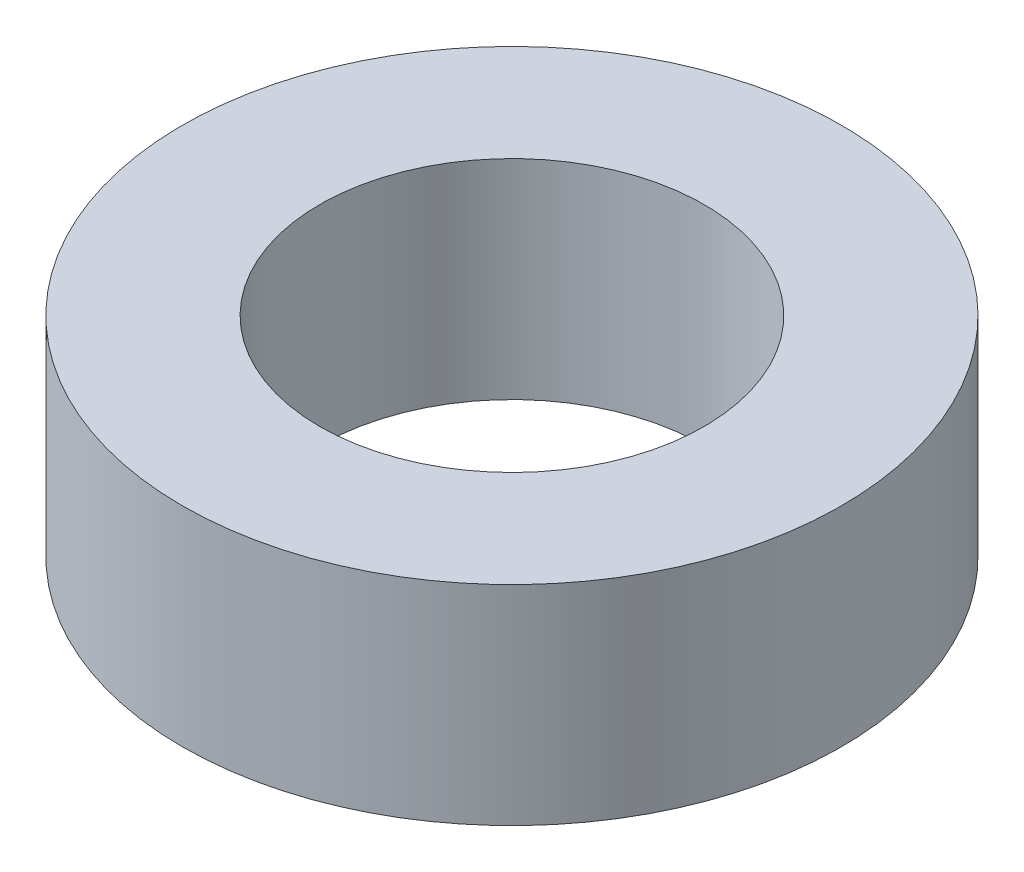
ISO-10303-21;
HEADER;
FILE_DESCRIPTION(('STEP AP214'),'2;1');
FILE_NAME('part.step','',(''),(''),'','','');
FILE_SCHEMA(('AUTOMOTIVE_DESIGN { 1 0 10303 214 1 1 1 1 }'));
ENDSEC;
DATA;
#1=APPLICATION_CONTEXT('core data for automotive mechanical design processes');
#2=APPLICATION_PROTOCOL_DEFINITION('international standard','automotive_design',2000,#1);
#3=PRODUCT_CONTEXT('',#1,'mechanical');
#4=PRODUCT('Part','Part','',(#3));
#5=PRODUCT_RELATED_PRODUCT_CATEGORY('part','',(#4));
#6=PRODUCT_DEFINITION_FORMATION('','',#4);
#7=PRODUCT_DEFINITION_CONTEXT('part definition',#1,'design');
#8=PRODUCT_DEFINITION('design','',#6,#7);
#9=PRODUCT_DEFINITION_SHAPE('','',#8);
#10=(LENGTH_UNIT() NAMED_UNIT(*) SI_UNIT(.MILLI.,.METRE.));
#11=(NAMED_UNIT(*) PLANE_ANGLE_UNIT() SI_UNIT($,.RADIAN.));
#12=(NAMED_UNIT(*) SI_UNIT($,.STERADIAN.) SOLID_ANGLE_UNIT());
#13=UNCERTAINTY_MEASURE_WITH_UNIT(LENGTH_MEASURE(1.E-05),#10,'distance_accuracy_value','');
#14=(GEOMETRIC_REPRESENTATION_CONTEXT(3) GLOBAL_UNCERTAINTY_ASSIGNED_CONTEXT((#13)) GLOBAL_UNIT_ASSIGNED_CONTEXT((#10,
#11,#12)) REPRESENTATION_CONTEXT('',''));
#15=CARTESIAN_POINT('',(0.,0.,0.));
#16=DIRECTION('',(0.,0.,1.));
#17=DIRECTION('',(1.,0.,0.));
#18=AXIS2_PLACEMENT_3D('',#15,#16,#17);
#19=CARTESIAN_POINT('',(0.,19.,0.));
#20=DIRECTION('',(0.,-1.,0.));
#21=DIRECTION('',(0.,0.,-1.));
#22=AXIS2_PLACEMENT_3D('',#19,#20,#21);
#23=CYLINDRICAL_SURFACE('',#22,30.);
#24=CARTESIAN_POINT('',(0.,19.,0.));
#25=DIRECTION('',(0.,1.,0.));
#26=DIRECTION('',(0.,0.,1.));
#27=AXIS2_PLACEMENT_3D('',#24,#25,#26);
#28=CIRCLE('',#27,30.);
#29=CARTESIAN_POINT('',(0.,19.,30.));
#30=VERTEX_POINT('',#29);
#31=EDGE_CURVE('E10',#30,#30,#28,.T.);
#32=ORIENTED_EDGE('',*,*,#31,.F.);
#33=EDGE_LOOP('',(#32));
#34=FACE_BOUND('',#33,.T.);
#35=CARTESIAN_POINT('',(0.,0.,0.));
#36=DIRECTION('',(0.,1.,0.));
#37=DIRECTION('',(0.,0.,1.));
#38=AXIS2_PLACEMENT_3D('',#35,#36,#37);
#39=CIRCLE('',#38,30.);
#40=CARTESIAN_POINT('',(0.,0.,30.));
#41=VERTEX_POINT('',#40);
#42=EDGE_CURVE('E37',#41,#41,#39,.T.);
#43=ORIENTED_EDGE('',*,*,#42,.T.);
#44=EDGE_LOOP('',(#43));
#45=FACE_BOUND('',#44,.T.);
#46=ADVANCED_FACE('F40',(#34,#45),#23,.T.);
#47=CARTESIAN_POINT('',(0.,19.,0.));
#48=DIRECTION('',(0.,1.,0.));
#49=DIRECTION('',(0.,0.,1.));
#50=AXIS2_PLACEMENT_3D('',#47,#48,#49);
#51=PLANE('',#50);
#52=CARTESIAN_POINT('',(0.,19.,0.));
#53=DIRECTION('',(0.,1.,0.));
#54=DIRECTION('',(0.,0.,1.));
#55=AXIS2_PLACEMENT_3D('',#52,#53,#54);
#56=CIRCLE('',#55,17.5);
#57=CARTESIAN_POINT('',(0.,19.,17.5));
#58=VERTEX_POINT('',#57);
#59=EDGE_CURVE('E50',#58,#58,#56,.T.);
#60=ORIENTED_EDGE('',*,*,#59,.F.);
#61=EDGE_LOOP('',(#60));
#62=FACE_BOUND('',#61,.T.);
#63=ORIENTED_EDGE('',*,*,#31,.T.);
#64=EDGE_LOOP('',(#63));
#65=FACE_BOUND('',#64,.T.);
#66=ADVANCED_FACE('F59',(#62,#65),#51,.T.);
#67=CARTESIAN_POINT('',(0.,0.,0.));
#68=DIRECTION('',(0.,1.,0.));
#69=DIRECTION('',(0.,0.,1.));
#70=AXIS2_PLACEMENT_3D('',#67,#68,#69);
#71=PLANE('',#70);
#72=CARTESIAN_POINT('',(0.,0.,0.));
#73=DIRECTION('',(0.,1.,0.));
#74=DIRECTION('',(0.,0.,1.));
#75=AXIS2_PLACEMENT_3D('',#72,#73,#74);
#76=CIRCLE('',#75,17.5);
#77=CARTESIAN_POINT('',(0.,0.,17.5));
#78=VERTEX_POINT('',#77);
#79=EDGE_CURVE('E47',#78,#78,#76,.T.);
#80=ORIENTED_EDGE('',*,*,#79,.T.);
#81=EDGE_LOOP('',(#80));
#82=FACE_BOUND('',#81,.T.);
#83=ORIENTED_EDGE('',*,*,#42,.F.);
#84=EDGE_LOOP('',(#83));
#85=FACE_BOUND('',#84,.T.);
#86=ADVANCED_FACE('F58',(#82,#85),#71,.F.);
#87=CARTESIAN_POINT('',(0.,19.,0.));
#88=DIRECTION('',(0.,-1.,0.));
#89=DIRECTION('',(0.,0.,-1.));
#90=AXIS2_PLACEMENT_3D('',#87,#88,#89);
#91=CYLINDRICAL_SURFACE('',#90,17.5);
#92=ORIENTED_EDGE('',*,*,#59,.T.);
#93=EDGE_LOOP('',(#92));
#94=FACE_BOUND('',#93,.T.);
#95=ORIENTED_EDGE('',*,*,#79,.F.);
#96=EDGE_LOOP('',(#95));
#97=FACE_BOUND('',#96,.T.);
#98=ADVANCED_FACE('F54',(#94,#97),#91,.F.);
#99=CLOSED_SHELL('',(#46,#66,#86,#98));
#100=MANIFOLD_SOLID_BREP('B2',#99);
#101=ADVANCED_BREP_SHAPE_REPRESENTATION('',(#18,#100),#14);
#102=SHAPE_DEFINITION_REPRESENTATION(#9,#101);
ENDSEC;
END-ISO-10303-21;
